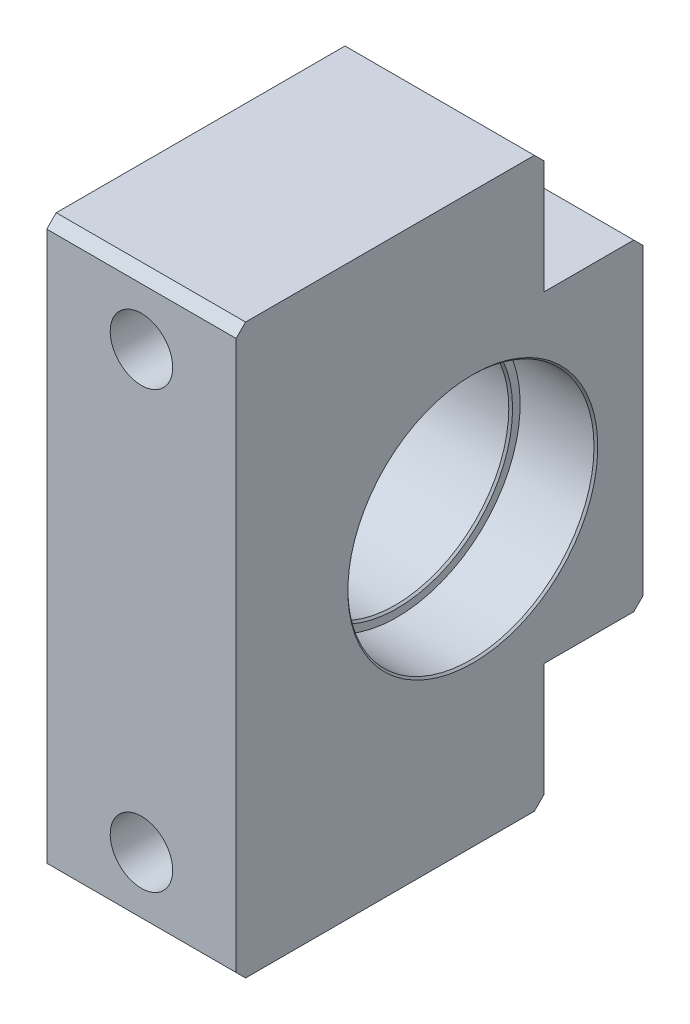
ISO-10303-21;
HEADER;
FILE_DESCRIPTION(('STEP AP214'),'2;1');
FILE_NAME('part.step','',(''),(''),'','','');
FILE_SCHEMA(('AUTOMOTIVE_DESIGN { 1 0 10303 214 1 1 1 1 }'));
ENDSEC;
DATA;
#1=APPLICATION_CONTEXT('core data for automotive mechanical design processes');
#2=APPLICATION_PROTOCOL_DEFINITION('international standard','automotive_design',2000,#1);
#3=PRODUCT_CONTEXT('',#1,'mechanical');
#4=PRODUCT('Part','Part','',(#3));
#5=PRODUCT_RELATED_PRODUCT_CATEGORY('part','',(#4));
#6=PRODUCT_DEFINITION_FORMATION('','',#4);
#7=PRODUCT_DEFINITION_CONTEXT('part definition',#1,'design');
#8=PRODUCT_DEFINITION('design','',#6,#7);
#9=PRODUCT_DEFINITION_SHAPE('','',#8);
#10=(LENGTH_UNIT() NAMED_UNIT(*) SI_UNIT(.MILLI.,.METRE.));
#11=(NAMED_UNIT(*) PLANE_ANGLE_UNIT() SI_UNIT($,.RADIAN.));
#12=(NAMED_UNIT(*) SI_UNIT($,.STERADIAN.) SOLID_ANGLE_UNIT());
#13=UNCERTAINTY_MEASURE_WITH_UNIT(LENGTH_MEASURE(1.E-05),#10,'distance_accuracy_value','');
#14=(GEOMETRIC_REPRESENTATION_CONTEXT(3) GLOBAL_UNCERTAINTY_ASSIGNED_CONTEXT((#13)) GLOBAL_UNIT_ASSIGNED_CONTEXT((#10,
#11,#12)) REPRESENTATION_CONTEXT('',''));
#15=CARTESIAN_POINT('',(0.,0.,0.));
#16=DIRECTION('',(0.,0.,1.));
#17=DIRECTION('',(1.,0.,0.));
#18=AXIS2_PLACEMENT_3D('',#15,#16,#17);
#19=CARTESIAN_POINT('',(17.7505100088882,0.,-27.6794951112317));
#20=DIRECTION('',(1.,0.,0.));
#21=DIRECTION('',(0.,0.,-1.));
#22=AXIS2_PLACEMENT_3D('',#19,#20,#21);
#23=PLANE('',#22);
#24=CARTESIAN_POINT('',(17.7505100088882,0.,-27.6794951112317));
#25=DIRECTION('',(-1.,0.,0.));
#26=DIRECTION('',(0.,0.,1.));
#27=AXIS2_PLACEMENT_3D('',#24,#25,#26);
#28=CIRCLE('',#27,13.);
#29=CARTESIAN_POINT('',(17.7505100088882,0.,-14.6794951112317));
#30=VERTEX_POINT('',#29);
#31=EDGE_CURVE('E20',#30,#30,#28,.F.);
#32=ORIENTED_EDGE('',*,*,#31,.T.);
#33=EDGE_LOOP('',(#32));
#34=FACE_BOUND('',#33,.T.);
#35=CARTESIAN_POINT('',(17.7505100088882,0.,-27.6794951112317));
#36=DIRECTION('',(1.,0.,0.));
#37=DIRECTION('',(0.,0.,-1.));
#38=AXIS2_PLACEMENT_3D('',#35,#36,#37);
#39=CIRCLE('',#38,12.2);
#40=CARTESIAN_POINT('',(17.7505100088882,0.,-39.8794951112317));
#41=VERTEX_POINT('',#40);
#42=EDGE_CURVE('E181',#41,#41,#39,.F.);
#43=ORIENTED_EDGE('',*,*,#42,.T.);
#44=EDGE_LOOP('',(#43));
#45=FACE_BOUND('',#44,.T.);
#46=ADVANCED_FACE('F17',(#34,#45),#23,.T.);
#47=CARTESIAN_POINT('',(25.7505100088882,0.,-27.6794951112317));
#48=DIRECTION('',(-1.,0.,0.));
#49=DIRECTION('',(0.,0.,1.));
#50=AXIS2_PLACEMENT_3D('',#47,#48,#49);
#51=CYLINDRICAL_SURFACE('',#50,13.);
#52=ORIENTED_EDGE('',*,*,#31,.F.);
#53=EDGE_LOOP('',(#52));
#54=FACE_BOUND('',#53,.T.);
#55=CARTESIAN_POINT('',(25.5505100088882,0.,-27.6794951112317));
#56=DIRECTION('',(1.,0.,0.));
#57=DIRECTION('',(0.,0.,-1.));
#58=AXIS2_PLACEMENT_3D('',#55,#56,#57);
#59=CIRCLE('',#58,13.);
#60=CARTESIAN_POINT('',(25.5505100088882,0.,-40.6794951112317));
#61=VERTEX_POINT('',#60);
#62=EDGE_CURVE('E178',#61,#61,#59,.T.);
#63=ORIENTED_EDGE('',*,*,#62,.T.);
#64=EDGE_LOOP('',(#63));
#65=FACE_BOUND('',#64,.T.);
#66=ADVANCED_FACE('F215',(#54,#65),#51,.F.);
#67=CARTESIAN_POINT('',(17.7505100088882,0.,-27.6794951112317));
#68=DIRECTION('',(1.,0.,0.));
#69=DIRECTION('',(0.,0.,-1.));
#70=AXIS2_PLACEMENT_3D('',#67,#68,#69);
#71=CONICAL_SURFACE('',#70,12.2,0.785398163397457);
#72=CARTESIAN_POINT('',(17.5505100088882,0.,-27.6794951112317));
#73=DIRECTION('',(-1.,0.,0.));
#74=DIRECTION('',(0.,0.,1.));
#75=AXIS2_PLACEMENT_3D('',#72,#73,#74);
#76=CIRCLE('',#75,12.);
#77=CARTESIAN_POINT('',(17.5505100088882,0.,-15.6794951112317));
#78=VERTEX_POINT('',#77);
#79=EDGE_CURVE('E174',#78,#78,#76,.T.);
#80=ORIENTED_EDGE('',*,*,#79,.T.);
#81=EDGE_LOOP('',(#80));
#82=FACE_BOUND('',#81,.T.);
#83=ORIENTED_EDGE('',*,*,#42,.F.);
#84=EDGE_LOOP('',(#83));
#85=FACE_BOUND('',#84,.T.);
#86=ADVANCED_FACE('F218',(#82,#85),#71,.F.);
#87=CARTESIAN_POINT('',(19.0505100088882,23.,-33.1794951112318));
#88=DIRECTION('',(0.,0.,1.));
#89=DIRECTION('',(0.,-1.,0.));
#90=AXIS2_PLACEMENT_3D('',#87,#88,#89);
#91=PLANE('',#90);
#92=CARTESIAN_POINT('',(15.7505100088882,23.,-33.1794951112318));
#93=DIRECTION('',(0.,0.,-1.));
#94=DIRECTION('',(0.,1.,0.));
#95=AXIS2_PLACEMENT_3D('',#92,#93,#94);
#96=CIRCLE('',#95,5.75);
#97=CARTESIAN_POINT('',(15.7505100088882,28.75,-33.1794951112318));
#98=VERTEX_POINT('',#97);
#99=EDGE_CURVE('E169',#98,#98,#96,.T.);
#100=ORIENTED_EDGE('',*,*,#99,.T.);
#101=EDGE_LOOP('',(#100));
#102=FACE_BOUND('',#101,.T.);
#103=CARTESIAN_POINT('',(15.7505100088882,23.,-33.1794951112318));
#104=DIRECTION('',(0.,0.,-1.));
#105=DIRECTION('',(0.,1.,0.));
#106=AXIS2_PLACEMENT_3D('',#103,#104,#105);
#107=CIRCLE('',#106,3.29999999999999);
#108=CARTESIAN_POINT('',(15.7505100088882,26.3,-33.1794951112318));
#109=VERTEX_POINT('',#108);
#110=EDGE_CURVE('E177',#109,#109,#107,.F.);
#111=ORIENTED_EDGE('',*,*,#110,.T.);
#112=EDGE_LOOP('',(#111));
#113=FACE_BOUND('',#112,.T.);
#114=ADVANCED_FACE('F235',(#102,#113),#91,.F.);
#115=CARTESIAN_POINT('',(19.0505100088882,-23.,-33.1794951112318));
#116=DIRECTION('',(0.,0.,1.));
#117=DIRECTION('',(0.,-1.,0.));
#118=AXIS2_PLACEMENT_3D('',#115,#116,#117);
#119=PLANE('',#118);
#120=CARTESIAN_POINT('',(15.7505100088882,-23.,-33.1794951112318));
#121=DIRECTION('',(0.,0.,-1.));
#122=DIRECTION('',(0.,1.,0.));
#123=AXIS2_PLACEMENT_3D('',#120,#121,#122);
#124=CIRCLE('',#123,5.75);
#125=CARTESIAN_POINT('',(15.7505100088882,-17.25,-33.1794951112318));
#126=VERTEX_POINT('',#125);
#127=EDGE_CURVE('E164',#126,#126,#124,.T.);
#128=ORIENTED_EDGE('',*,*,#127,.T.);
#129=EDGE_LOOP('',(#128));
#130=FACE_BOUND('',#129,.T.);
#131=CARTESIAN_POINT('',(15.7505100088882,-23.,-33.1794951112318));
#132=DIRECTION('',(0.,0.,-1.));
#133=DIRECTION('',(0.,1.,0.));
#134=AXIS2_PLACEMENT_3D('',#131,#132,#133);
#135=CIRCLE('',#134,3.29999999999999);
#136=CARTESIAN_POINT('',(15.7505100088882,-19.7,-33.1794951112318));
#137=VERTEX_POINT('',#136);
#138=EDGE_CURVE('E171',#137,#137,#135,.F.);
#139=ORIENTED_EDGE('',*,*,#138,.T.);
#140=EDGE_LOOP('',(#139));
#141=FACE_BOUND('',#140,.T.);
#142=ADVANCED_FACE('F224',(#130,#141),#119,.F.);
#143=CARTESIAN_POINT('',(25.7505100088882,0.,-27.6794951112317));
#144=DIRECTION('',(1.,0.,0.));
#145=DIRECTION('',(0.,1.,0.));
#146=AXIS2_PLACEMENT_3D('',#143,#144,#145);
#147=CONICAL_SURFACE('',#146,13.2,0.785398163397448);
#148=CARTESIAN_POINT('',(25.7505100088882,0.,-27.6794951112317));
#149=DIRECTION('',(1.,0.,0.));
#150=DIRECTION('',(0.,1.,0.));
#151=AXIS2_PLACEMENT_3D('',#148,#149,#150);
#152=CIRCLE('',#151,13.2);
#153=CARTESIAN_POINT('',(25.7505100088882,13.2,-27.6794951112317));
#154=VERTEX_POINT('',#153);
#155=EDGE_CURVE('E161',#154,#154,#152,.T.);
#156=ORIENTED_EDGE('',*,*,#155,.T.);
#157=EDGE_LOOP('',(#156));
#158=FACE_BOUND('',#157,.T.);
#159=ORIENTED_EDGE('',*,*,#62,.F.);
#160=EDGE_LOOP('',(#159));
#161=FACE_BOUND('',#160,.T.);
#162=ADVANCED_FACE('F221',(#158,#161),#147,.F.);
#163=CARTESIAN_POINT('',(17.7505100088882,0.,-27.6794951112317));
#164=DIRECTION('',(-1.,0.,0.));
#165=DIRECTION('',(0.,0.,1.));
#166=AXIS2_PLACEMENT_3D('',#163,#164,#165);
#167=CYLINDRICAL_SURFACE('',#166,12.);
#168=ORIENTED_EDGE('',*,*,#79,.F.);
#169=EDGE_LOOP('',(#168));
#170=FACE_BOUND('',#169,.T.);
#171=CARTESIAN_POINT('',(5.95051000888817,0.,-27.6794951112317));
#172=DIRECTION('',(-1.,0.,0.));
#173=DIRECTION('',(0.,0.,1.));
#174=AXIS2_PLACEMENT_3D('',#171,#172,#173);
#175=CIRCLE('',#174,12.);
#176=CARTESIAN_POINT('',(5.95051000888818,0.,-15.6794951112317));
#177=VERTEX_POINT('',#176);
#178=EDGE_CURVE('E150',#177,#177,#175,.T.);
#179=ORIENTED_EDGE('',*,*,#178,.T.);
#180=EDGE_LOOP('',(#179));
#181=FACE_BOUND('',#180,.T.);
#182=ADVANCED_FACE('F223',(#170,#181),#167,.F.);
#183=CARTESIAN_POINT('',(15.7505100088882,23.,-35.1794951112318));
#184=DIRECTION('',(0.,0.,-1.));
#185=DIRECTION('',(0.,1.,0.));
#186=AXIS2_PLACEMENT_3D('',#183,#184,#185);
#187=CYLINDRICAL_SURFACE('',#186,3.29999999999999);
#188=CARTESIAN_POINT('',(15.7505100088882,23.,-2.67949511123176));
#189=DIRECTION('',(0.,0.,-1.));
#190=DIRECTION('',(0.,1.,0.));
#191=AXIS2_PLACEMENT_3D('',#188,#189,#190);
#192=CIRCLE('',#191,3.29999999999999);
#193=CARTESIAN_POINT('',(15.7505100088882,26.3,-2.67949511123177));
#194=VERTEX_POINT('',#193);
#195=EDGE_CURVE('E144',#194,#194,#192,.T.);
#196=ORIENTED_EDGE('',*,*,#195,.F.);
#197=EDGE_LOOP('',(#196));
#198=FACE_BOUND('',#197,.T.);
#199=ORIENTED_EDGE('',*,*,#110,.F.);
#200=EDGE_LOOP('',(#199));
#201=FACE_BOUND('',#200,.T.);
#202=ADVANCED_FACE('F232',(#198,#201),#187,.F.);
#203=CARTESIAN_POINT('',(15.7505100088882,-23.,-35.1794951112318));
#204=DIRECTION('',(0.,0.,-1.));
#205=DIRECTION('',(0.,1.,0.));
#206=AXIS2_PLACEMENT_3D('',#203,#204,#205);
#207=CYLINDRICAL_SURFACE('',#206,3.29999999999999);
#208=CARTESIAN_POINT('',(15.7505100088882,-23.,-2.67949511123173));
#209=DIRECTION('',(0.,0.,-1.));
#210=DIRECTION('',(0.,1.,0.));
#211=AXIS2_PLACEMENT_3D('',#208,#209,#210);
#212=CIRCLE('',#211,3.29999999999999);
#213=CARTESIAN_POINT('',(15.7505100088882,-19.7,-2.67949511123173));
#214=VERTEX_POINT('',#213);
#215=EDGE_CURVE('E141',#214,#214,#212,.T.);
#216=ORIENTED_EDGE('',*,*,#215,.F.);
#217=EDGE_LOOP('',(#216));
#218=FACE_BOUND('',#217,.T.);
#219=ORIENTED_EDGE('',*,*,#138,.F.);
#220=EDGE_LOOP('',(#219));
#221=FACE_BOUND('',#220,.T.);
#222=ADVANCED_FACE('F311',(#218,#221),#207,.F.);
#223=CARTESIAN_POINT('',(25.7505100088882,29.,-2.67949511123177));
#224=DIRECTION('',(0.,-0.707106781186551,-0.707106781186544));
#225=DIRECTION('',(0.,0.707106781186544,-0.707106781186551));
#226=AXIS2_PLACEMENT_3D('',#223,#224,#225);
#227=PLANE('',#226);
#228=DIRECTION('',(1.,0.,0.));
#229=VECTOR('',#228,1.);
#230=CARTESIAN_POINT('',(25.7505100088882,30.,-3.67949511123178));
#231=LINE('',#230,#229);
#232=CARTESIAN_POINT('',(5.75051000888817,30.,-3.67949511123178));
#233=VERTEX_POINT('',#232);
#234=CARTESIAN_POINT('',(25.7505100088882,30.,-3.67949511123178));
#235=VERTEX_POINT('',#234);
#236=EDGE_CURVE('E581',#233,#235,#231,.T.);
#237=ORIENTED_EDGE('',*,*,#236,.F.);
#238=DIRECTION('',(0.,0.707106781186544,-0.707106781186551));
#239=VECTOR('',#238,1.);
#240=CARTESIAN_POINT('',(5.75051000888817,29.,-2.67949511123177));
#241=LINE('',#240,#239);
#242=CARTESIAN_POINT('',(5.75051000888817,29.,-2.67949511123175));
#243=VERTEX_POINT('',#242);
#244=EDGE_CURVE('E132',#243,#233,#241,.T.);
#245=ORIENTED_EDGE('',*,*,#244,.F.);
#246=DIRECTION('',(1.,0.,0.));
#247=VECTOR('',#246,1.);
#248=CARTESIAN_POINT('',(25.7505100088882,29.,-2.67949511123177));
#249=LINE('',#248,#247);
#250=CARTESIAN_POINT('',(25.7505100088882,29.,-2.67949511123175));
#251=VERTEX_POINT('',#250);
#252=EDGE_CURVE('E130',#251,#243,#249,.F.);
#253=ORIENTED_EDGE('',*,*,#252,.F.);
#254=DIRECTION('',(0.,0.707106781186538,-0.707106781186557));
#255=VECTOR('',#254,1.);
#256=CARTESIAN_POINT('',(25.7505100088882,29.,-2.67949511123175));
#257=LINE('',#256,#255);
#258=EDGE_CURVE('E118',#251,#235,#257,.T.);
#259=ORIENTED_EDGE('',*,*,#258,.T.);
#260=EDGE_LOOP('',(#237,#245,#253,#259));
#261=FACE_BOUND('',#260,.T.);
#262=ADVANCED_FACE('F131',(#261),#227,.F.);
#263=CARTESIAN_POINT('',(15.7505100088882,23.,-35.1794951112318));
#264=DIRECTION('',(0.,0.,-1.));
#265=DIRECTION('',(0.,1.,0.));
#266=AXIS2_PLACEMENT_3D('',#263,#264,#265);
#267=CYLINDRICAL_SURFACE('',#266,5.75);
#268=CARTESIAN_POINT('',(15.7505100088882,23.,-35.1794951112318));
#269=DIRECTION('',(0.,0.,-1.));
#270=DIRECTION('',(0.,1.,0.));
#271=AXIS2_PLACEMENT_3D('',#268,#269,#270);
#272=CIRCLE('',#271,5.75);
#273=CARTESIAN_POINT('',(15.7505100088882,28.75,-35.1794951112318));
#274=VERTEX_POINT('',#273);
#275=EDGE_CURVE('E192',#274,#274,#272,.F.);
#276=ORIENTED_EDGE('',*,*,#275,.F.);
#277=EDGE_LOOP('',(#276));
#278=FACE_BOUND('',#277,.T.);
#279=ORIENTED_EDGE('',*,*,#99,.F.);
#280=EDGE_LOOP('',(#279));
#281=FACE_BOUND('',#280,.T.);
#282=ADVANCED_FACE('F304',(#278,#281),#267,.F.);
#283=CARTESIAN_POINT('',(25.7505100088882,30.,-34.1794951112318));
#284=DIRECTION('',(0.,-0.707106781186545,0.70710678118655));
#285=DIRECTION('',(0.,-0.70710678118655,-0.707106781186545));
#286=AXIS2_PLACEMENT_3D('',#283,#284,#285);
#287=PLANE('',#286);
#288=DIRECTION('',(1.,0.,0.));
#289=VECTOR('',#288,1.);
#290=CARTESIAN_POINT('',(25.7505100088882,29.,-35.1794951112318));
#291=LINE('',#290,#289);
#292=CARTESIAN_POINT('',(5.75051000888817,29.,-35.1794951112318));
#293=VERTEX_POINT('',#292);
#294=CARTESIAN_POINT('',(25.7505100088882,29.,-35.1794951112318));
#295=VERTEX_POINT('',#294);
#296=EDGE_CURVE('E194',#293,#295,#291,.T.);
#297=ORIENTED_EDGE('',*,*,#296,.F.);
#298=DIRECTION('',(0.,-0.70710678118655,-0.707106781186545));
#299=VECTOR('',#298,1.);
#300=CARTESIAN_POINT('',(5.75051000888817,30.,-34.1794951112318));
#301=LINE('',#300,#299);
#302=CARTESIAN_POINT('',(5.75051000888817,30.,-34.1794951112318));
#303=VERTEX_POINT('',#302);
#304=EDGE_CURVE('E167',#303,#293,#301,.T.);
#305=ORIENTED_EDGE('',*,*,#304,.F.);
#306=DIRECTION('',(1.,0.,0.));
#307=VECTOR('',#306,1.);
#308=CARTESIAN_POINT('',(25.7505100088882,30.,-34.1794951112318));
#309=LINE('',#308,#307);
#310=CARTESIAN_POINT('',(25.7505100088882,30.,-34.1794951112318));
#311=VERTEX_POINT('',#310);
#312=EDGE_CURVE('E195',#311,#303,#309,.F.);
#313=ORIENTED_EDGE('',*,*,#312,.F.);
#314=DIRECTION('',(0.,-0.707106781186549,-0.707106781186546));
#315=VECTOR('',#314,1.);
#316=CARTESIAN_POINT('',(25.7505100088882,30.,-34.1794951112318));
#317=LINE('',#316,#315);
#318=EDGE_CURVE('E159',#311,#295,#317,.T.);
#319=ORIENTED_EDGE('',*,*,#318,.T.);
#320=EDGE_LOOP('',(#297,#305,#313,#319));
#321=FACE_BOUND('',#320,.T.);
#322=ADVANCED_FACE('F300',(#321),#287,.F.);
#323=CARTESIAN_POINT('',(25.7505100088882,17.,-44.6794951112318));
#324=DIRECTION('',(0.,-0.707106781186545,0.70710678118655));
#325=DIRECTION('',(0.,-0.70710678118655,-0.707106781186545));
#326=AXIS2_PLACEMENT_3D('',#323,#324,#325);
#327=PLANE('',#326);
#328=DIRECTION('',(1.,0.,0.));
#329=VECTOR('',#328,1.);
#330=CARTESIAN_POINT('',(25.7505100088882,16.,-45.6794951112318));
#331=LINE('',#330,#329);
#332=CARTESIAN_POINT('',(5.75051000888817,16.,-45.6794951112318));
#333=VERTEX_POINT('',#332);
#334=CARTESIAN_POINT('',(25.7505100088882,16.,-45.6794951112318));
#335=VERTEX_POINT('',#334);
#336=EDGE_CURVE('E562',#333,#335,#331,.T.);
#337=ORIENTED_EDGE('',*,*,#336,.F.);
#338=DIRECTION('',(0.,-0.70710678118655,-0.707106781186545));
#339=VECTOR('',#338,1.);
#340=CARTESIAN_POINT('',(5.75051000888817,17.,-44.6794951112318));
#341=LINE('',#340,#339);
#342=CARTESIAN_POINT('',(5.75051000888817,17.,-44.6794951112318));
#343=VERTEX_POINT('',#342);
#344=EDGE_CURVE('E165',#343,#333,#341,.T.);
#345=ORIENTED_EDGE('',*,*,#344,.F.);
#346=DIRECTION('',(1.,0.,0.));
#347=VECTOR('',#346,1.);
#348=CARTESIAN_POINT('',(25.7505100088882,17.,-44.6794951112318));
#349=LINE('',#348,#347);
#350=CARTESIAN_POINT('',(25.7505100088882,17.,-44.6794951112318));
#351=VERTEX_POINT('',#350);
#352=EDGE_CURVE('E572',#351,#343,#349,.F.);
#353=ORIENTED_EDGE('',*,*,#352,.F.);
#354=DIRECTION('',(0.,-0.70710678118655,-0.707106781186545));
#355=VECTOR('',#354,1.);
#356=CARTESIAN_POINT('',(25.7505100088882,17.,-44.6794951112318));
#357=LINE('',#356,#355);
#358=EDGE_CURVE('E157',#351,#335,#357,.T.);
#359=ORIENTED_EDGE('',*,*,#358,.T.);
#360=EDGE_LOOP('',(#337,#345,#353,#359));
#361=FACE_BOUND('',#360,.T.);
#362=ADVANCED_FACE('F296',(#361),#327,.F.);
#363=CARTESIAN_POINT('',(25.7505100088882,-16.,-45.6794951112318));
#364=DIRECTION('',(0.,0.707106781186548,0.707106781186548));
#365=DIRECTION('',(0.,-0.707106781186548,0.707106781186548));
#366=AXIS2_PLACEMENT_3D('',#363,#364,#365);
#367=PLANE('',#366);
#368=DIRECTION('',(1.,0.,0.));
#369=VECTOR('',#368,1.);
#370=CARTESIAN_POINT('',(25.7505100088882,-17.,-44.6794951112318));
#371=LINE('',#370,#369);
#372=CARTESIAN_POINT('',(5.75051000888817,-17.,-44.6794951112318));
#373=VERTEX_POINT('',#372);
#374=CARTESIAN_POINT('',(25.7505100088882,-17.,-44.6794951112318));
#375=VERTEX_POINT('',#374);
#376=EDGE_CURVE('E559',#373,#375,#371,.T.);
#377=ORIENTED_EDGE('',*,*,#376,.F.);
#378=DIRECTION('',(0.,-0.707106781186548,0.707106781186548));
#379=VECTOR('',#378,1.);
#380=CARTESIAN_POINT('',(5.75051000888817,-16.,-45.6794951112318));
#381=LINE('',#380,#379);
#382=CARTESIAN_POINT('',(5.75051000888817,-16.,-45.6794951112318));
#383=VERTEX_POINT('',#382);
#384=EDGE_CURVE('E162',#383,#373,#381,.T.);
#385=ORIENTED_EDGE('',*,*,#384,.F.);
#386=DIRECTION('',(1.,0.,0.));
#387=VECTOR('',#386,1.);
#388=CARTESIAN_POINT('',(25.7505100088882,-16.,-45.6794951112318));
#389=LINE('',#388,#387);
#390=CARTESIAN_POINT('',(25.7505100088882,-16.,-45.6794951112318));
#391=VERTEX_POINT('',#390);
#392=EDGE_CURVE('E565',#391,#383,#389,.F.);
#393=ORIENTED_EDGE('',*,*,#392,.F.);
#394=DIRECTION('',(0.,-0.707106781186547,0.707106781186547));
#395=VECTOR('',#394,1.);
#396=CARTESIAN_POINT('',(25.7505100088882,-16.,-45.6794951112318));
#397=LINE('',#396,#395);
#398=EDGE_CURVE('E127',#391,#375,#397,.T.);
#399=ORIENTED_EDGE('',*,*,#398,.T.);
#400=EDGE_LOOP('',(#377,#385,#393,#399));
#401=FACE_BOUND('',#400,.T.);
#402=ADVANCED_FACE('F292',(#401),#367,.F.);
#403=CARTESIAN_POINT('',(15.7505100088882,-23.,-35.1794951112318));
#404=DIRECTION('',(0.,0.,-1.));
#405=DIRECTION('',(0.,1.,0.));
#406=AXIS2_PLACEMENT_3D('',#403,#404,#405);
#407=CYLINDRICAL_SURFACE('',#406,5.75);
#408=CARTESIAN_POINT('',(15.7505100088882,-23.,-35.1794951112318));
#409=DIRECTION('',(0.,0.,-1.));
#410=DIRECTION('',(0.,1.,0.));
#411=AXIS2_PLACEMENT_3D('',#408,#409,#410);
#412=CIRCLE('',#411,5.75);
#413=CARTESIAN_POINT('',(15.7505100088882,-17.25,-35.1794951112318));
#414=VERTEX_POINT('',#413);
#415=EDGE_CURVE('E187',#414,#414,#412,.F.);
#416=ORIENTED_EDGE('',*,*,#415,.F.);
#417=EDGE_LOOP('',(#416));
#418=FACE_BOUND('',#417,.T.);
#419=ORIENTED_EDGE('',*,*,#127,.F.);
#420=EDGE_LOOP('',(#419));
#421=FACE_BOUND('',#420,.T.);
#422=ADVANCED_FACE('F289',(#418,#421),#407,.F.);
#423=CARTESIAN_POINT('',(25.7505100088882,0.,0.));
#424=DIRECTION('',(-1.,0.,0.));
#425=DIRECTION('',(0.,0.,1.));
#426=AXIS2_PLACEMENT_3D('',#423,#424,#425);
#427=PLANE('',#426);
#428=ORIENTED_EDGE('',*,*,#258,.F.);
#429=DIRECTION('',(0.,-1.,0.));
#430=VECTOR('',#429,1.);
#431=CARTESIAN_POINT('',(25.7505100088882,30.,-2.67949511123177));
#432=LINE('',#431,#430);
#433=CARTESIAN_POINT('',(25.7505100088882,-29.,-2.67949511123173));
#434=VERTEX_POINT('',#433);
#435=EDGE_CURVE('E115',#434,#251,#432,.F.);
#436=ORIENTED_EDGE('',*,*,#435,.F.);
#437=DIRECTION('',(0.,0.707106781186549,0.707106781186546));
#438=VECTOR('',#437,1.);
#439=CARTESIAN_POINT('',(25.7505100088882,-30.,-3.67949511123175));
#440=LINE('',#439,#438);
#441=CARTESIAN_POINT('',(25.7505100088882,-30.,-3.67949511123176));
#442=VERTEX_POINT('',#441);
#443=EDGE_CURVE('E153',#434,#442,#440,.F.);
#444=ORIENTED_EDGE('',*,*,#443,.T.);
#445=DIRECTION('',(0.,0.,-1.));
#446=VECTOR('',#445,1.);
#447=CARTESIAN_POINT('',(25.7505100088882,-30.,-35.1794951112318));
#448=LINE('',#447,#446);
#449=CARTESIAN_POINT('',(25.7505100088882,-30.,-34.1794951112318));
#450=VERTEX_POINT('',#449);
#451=EDGE_CURVE('E546',#450,#442,#448,.F.);
#452=ORIENTED_EDGE('',*,*,#451,.F.);
#453=DIRECTION('',(0.,-0.707106781186545,0.70710678118655));
#454=VECTOR('',#453,1.);
#455=CARTESIAN_POINT('',(25.7505100088882,-29.,-35.1794951112318));
#456=LINE('',#455,#454);
#457=CARTESIAN_POINT('',(25.7505100088882,-29.,-35.1794951112318));
#458=VERTEX_POINT('',#457);
#459=EDGE_CURVE('E148',#450,#458,#456,.F.);
#460=ORIENTED_EDGE('',*,*,#459,.T.);
#461=DIRECTION('',(0.,1.,0.));
#462=VECTOR('',#461,1.);
#463=CARTESIAN_POINT('',(25.7505100088882,-17.,-35.1794951112318));
#464=LINE('',#463,#462);
#465=CARTESIAN_POINT('',(25.7505100088882,-17.,-35.1794951112318));
#466=VERTEX_POINT('',#465);
#467=EDGE_CURVE('E190',#466,#458,#464,.F.);
#468=ORIENTED_EDGE('',*,*,#467,.F.);
#469=DIRECTION('',(0.,0.,-1.));
#470=VECTOR('',#469,1.);
#471=CARTESIAN_POINT('',(25.7505100088882,-17.,-45.6794951112318));
#472=LINE('',#471,#470);
#473=EDGE_CURVE('E191',#375,#466,#472,.F.);
#474=ORIENTED_EDGE('',*,*,#473,.F.);
#475=ORIENTED_EDGE('',*,*,#398,.F.);
#476=DIRECTION('',(0.,1.,0.));
#477=VECTOR('',#476,1.);
#478=CARTESIAN_POINT('',(25.7505100088882,17.,-45.6794951112318));
#479=LINE('',#478,#477);
#480=EDGE_CURVE('E568',#335,#391,#479,.F.);
#481=ORIENTED_EDGE('',*,*,#480,.F.);
#482=ORIENTED_EDGE('',*,*,#358,.F.);
#483=DIRECTION('',(0.,0.,1.));
#484=VECTOR('',#483,1.);
#485=CARTESIAN_POINT('',(25.7505100088882,17.,-45.6794951112318));
#486=LINE('',#485,#484);
#487=CARTESIAN_POINT('',(25.7505100088882,17.,-35.1794951112318));
#488=VERTEX_POINT('',#487);
#489=EDGE_CURVE('E575',#488,#351,#486,.F.);
#490=ORIENTED_EDGE('',*,*,#489,.F.);
#491=DIRECTION('',(0.,1.,0.));
#492=VECTOR('',#491,1.);
#493=CARTESIAN_POINT('',(25.7505100088882,17.,-35.1794951112318));
#494=LINE('',#493,#492);
#495=EDGE_CURVE('E524',#295,#488,#494,.F.);
#496=ORIENTED_EDGE('',*,*,#495,.F.);
#497=ORIENTED_EDGE('',*,*,#318,.F.);
#498=DIRECTION('',(0.,0.,1.));
#499=VECTOR('',#498,1.);
#500=CARTESIAN_POINT('',(25.7505100088882,30.,-35.1794951112318));
#501=LINE('',#500,#499);
#502=EDGE_CURVE('E123',#235,#311,#501,.F.);
#503=ORIENTED_EDGE('',*,*,#502,.F.);
#504=EDGE_LOOP('',(#428,#436,#444,#452,#460,#468,#474,#475,#481,#482,#490,#496,#497,#503));
#505=FACE_BOUND('',#504,.T.);
#506=ORIENTED_EDGE('',*,*,#155,.F.);
#507=EDGE_LOOP('',(#506));
#508=FACE_BOUND('',#507,.T.);
#509=ADVANCED_FACE('F120',(#505,#508),#427,.F.);
#510=CARTESIAN_POINT('',(25.7505100088882,-30.,-3.67949511123175));
#511=DIRECTION('',(0.,0.707106781186546,-0.707106781186549));
#512=DIRECTION('',(0.,0.707106781186549,0.707106781186546));
#513=AXIS2_PLACEMENT_3D('',#510,#511,#512);
#514=PLANE('',#513);
#515=DIRECTION('',(1.,0.,0.));
#516=VECTOR('',#515,1.);
#517=CARTESIAN_POINT('',(25.7505100088882,-29.,-2.67949511123173));
#518=LINE('',#517,#516);
#519=CARTESIAN_POINT('',(5.75051000888817,-29.,-2.67949511123173));
#520=VERTEX_POINT('',#519);
#521=EDGE_CURVE('E136',#520,#434,#518,.T.);
#522=ORIENTED_EDGE('',*,*,#521,.F.);
#523=DIRECTION('',(0.,0.707106781186549,0.707106781186546));
#524=VECTOR('',#523,1.);
#525=CARTESIAN_POINT('',(5.75051000888817,-30.,-3.67949511123175));
#526=LINE('',#525,#524);
#527=CARTESIAN_POINT('',(5.75051000888817,-30.,-3.67949511123176));
#528=VERTEX_POINT('',#527);
#529=EDGE_CURVE('E35',#528,#520,#526,.T.);
#530=ORIENTED_EDGE('',*,*,#529,.F.);
#531=DIRECTION('',(1.,0.,0.));
#532=VECTOR('',#531,1.);
#533=CARTESIAN_POINT('',(25.7505100088882,-30.,-3.67949511123175));
#534=LINE('',#533,#532);
#535=EDGE_CURVE('E544',#442,#528,#534,.F.);
#536=ORIENTED_EDGE('',*,*,#535,.F.);
#537=ORIENTED_EDGE('',*,*,#443,.F.);
#538=EDGE_LOOP('',(#522,#530,#536,#537));
#539=FACE_BOUND('',#538,.T.);
#540=ADVANCED_FACE('F283',(#539),#514,.F.);
#541=CARTESIAN_POINT('',(25.7505100088882,-29.,-35.1794951112318));
#542=DIRECTION('',(0.,0.70710678118655,0.707106781186545));
#543=DIRECTION('',(0.,-0.707106781186545,0.70710678118655));
#544=AXIS2_PLACEMENT_3D('',#541,#542,#543);
#545=PLANE('',#544);
#546=DIRECTION('',(1.,0.,0.));
#547=VECTOR('',#546,1.);
#548=CARTESIAN_POINT('',(25.7505100088882,-30.,-34.1794951112318));
#549=LINE('',#548,#547);
#550=CARTESIAN_POINT('',(5.75051000888817,-30.,-34.1794951112318));
#551=VERTEX_POINT('',#550);
#552=EDGE_CURVE('E186',#551,#450,#549,.T.);
#553=ORIENTED_EDGE('',*,*,#552,.F.);
#554=DIRECTION('',(0.,-0.707106781186545,0.70710678118655));
#555=VECTOR('',#554,1.);
#556=CARTESIAN_POINT('',(5.75051000888817,-29.,-35.1794951112318));
#557=LINE('',#556,#555);
#558=CARTESIAN_POINT('',(5.75051000888817,-29.,-35.1794951112318));
#559=VERTEX_POINT('',#558);
#560=EDGE_CURVE('E151',#559,#551,#557,.T.);
#561=ORIENTED_EDGE('',*,*,#560,.F.);
#562=DIRECTION('',(1.,0.,0.));
#563=VECTOR('',#562,1.);
#564=CARTESIAN_POINT('',(25.7505100088882,-29.,-35.1794951112318));
#565=LINE('',#564,#563);
#566=EDGE_CURVE('E552',#458,#559,#565,.F.);
#567=ORIENTED_EDGE('',*,*,#566,.F.);
#568=ORIENTED_EDGE('',*,*,#459,.F.);
#569=EDGE_LOOP('',(#553,#561,#567,#568));
#570=FACE_BOUND('',#569,.T.);
#571=ADVANCED_FACE('F279',(#570),#545,.F.);
#572=CARTESIAN_POINT('',(5.75051000888817,0.,-27.6794951112317));
#573=DIRECTION('',(-1.,0.,0.));
#574=DIRECTION('',(0.,0.,1.));
#575=AXIS2_PLACEMENT_3D('',#572,#573,#574);
#576=CONICAL_SURFACE('',#575,12.2,0.785398163397448);
#577=ORIENTED_EDGE('',*,*,#178,.F.);
#578=EDGE_LOOP('',(#577));
#579=FACE_BOUND('',#578,.T.);
#580=CARTESIAN_POINT('',(5.75051000888817,0.,-27.6794951112317));
#581=DIRECTION('',(-1.,0.,0.));
#582=DIRECTION('',(0.,0.,1.));
#583=AXIS2_PLACEMENT_3D('',#580,#581,#582);
#584=CIRCLE('',#583,12.2);
#585=CARTESIAN_POINT('',(5.75051000888817,0.,-15.4794951112317));
#586=VERTEX_POINT('',#585);
#587=EDGE_CURVE('E182',#586,#586,#584,.F.);
#588=ORIENTED_EDGE('',*,*,#587,.F.);
#589=EDGE_LOOP('',(#588));
#590=FACE_BOUND('',#589,.T.);
#591=ADVANCED_FACE('F276',(#579,#590),#576,.F.);
#592=CARTESIAN_POINT('',(25.7505100088882,30.,-2.67949511123177));
#593=DIRECTION('',(0.,0.,1.));
#594=DIRECTION('',(0.,-1.,0.));
#595=AXIS2_PLACEMENT_3D('',#592,#593,#594);
#596=PLANE('',#595);
#597=DIRECTION('',(0.,1.,0.));
#598=VECTOR('',#597,1.);
#599=CARTESIAN_POINT('',(5.75051000888817,0.,-2.67949511123173));
#600=LINE('',#599,#598);
#601=EDGE_CURVE('E185',#520,#243,#600,.T.);
#602=ORIENTED_EDGE('',*,*,#601,.F.);
#603=ORIENTED_EDGE('',*,*,#521,.T.);
#604=ORIENTED_EDGE('',*,*,#435,.T.);
#605=ORIENTED_EDGE('',*,*,#252,.T.);
#606=EDGE_LOOP('',(#602,#603,#604,#605));
#607=FACE_BOUND('',#606,.T.);
#608=ORIENTED_EDGE('',*,*,#215,.T.);
#609=EDGE_LOOP('',(#608));
#610=FACE_BOUND('',#609,.T.);
#611=ORIENTED_EDGE('',*,*,#195,.T.);
#612=EDGE_LOOP('',(#611));
#613=FACE_BOUND('',#612,.T.);
#614=ADVANCED_FACE('F139',(#607,#610,#613),#596,.T.);
#615=CARTESIAN_POINT('',(25.7505100088882,30.,-35.1794951112318));
#616=DIRECTION('',(0.,1.,0.));
#617=DIRECTION('',(0.,0.,1.));
#618=AXIS2_PLACEMENT_3D('',#615,#616,#617);
#619=PLANE('',#618);
#620=ORIENTED_EDGE('',*,*,#502,.T.);
#621=ORIENTED_EDGE('',*,*,#312,.T.);
#622=DIRECTION('',(0.,0.,1.));
#623=VECTOR('',#622,1.);
#624=CARTESIAN_POINT('',(5.75051000888817,30.,0.));
#625=LINE('',#624,#623);
#626=EDGE_CURVE('E533',#233,#303,#625,.F.);
#627=ORIENTED_EDGE('',*,*,#626,.F.);
#628=ORIENTED_EDGE('',*,*,#236,.T.);
#629=EDGE_LOOP('',(#620,#621,#627,#628));
#630=FACE_BOUND('',#629,.T.);
#631=ADVANCED_FACE('F269',(#630),#619,.T.);
#632=CARTESIAN_POINT('',(25.7505100088882,17.,-35.1794951112318));
#633=DIRECTION('',(0.,0.,-1.));
#634=DIRECTION('',(0.,1.,0.));
#635=AXIS2_PLACEMENT_3D('',#632,#633,#634);
#636=PLANE('',#635);
#637=ORIENTED_EDGE('',*,*,#495,.T.);
#638=DIRECTION('',(1.,0.,0.));
#639=VECTOR('',#638,1.);
#640=CARTESIAN_POINT('',(25.7505100088882,17.,-35.1794951112318));
#641=LINE('',#640,#639);
#642=CARTESIAN_POINT('',(5.75051000888817,17.,-35.1794951112318));
#643=VERTEX_POINT('',#642);
#644=EDGE_CURVE('E529',#643,#488,#641,.T.);
#645=ORIENTED_EDGE('',*,*,#644,.F.);
#646=DIRECTION('',(0.,1.,0.));
#647=VECTOR('',#646,1.);
#648=CARTESIAN_POINT('',(5.75051000888817,0.,-35.1794951112318));
#649=LINE('',#648,#647);
#650=EDGE_CURVE('E527',#293,#643,#649,.F.);
#651=ORIENTED_EDGE('',*,*,#650,.F.);
#652=ORIENTED_EDGE('',*,*,#296,.T.);
#653=EDGE_LOOP('',(#637,#645,#651,#652));
#654=FACE_BOUND('',#653,.T.);
#655=ORIENTED_EDGE('',*,*,#275,.T.);
#656=EDGE_LOOP('',(#655));
#657=FACE_BOUND('',#656,.T.);
#658=ADVANCED_FACE('F265',(#654,#657),#636,.T.);
#659=CARTESIAN_POINT('',(25.7505100088882,17.,-45.6794951112318));
#660=DIRECTION('',(0.,1.,0.));
#661=DIRECTION('',(0.,0.,1.));
#662=AXIS2_PLACEMENT_3D('',#659,#660,#661);
#663=PLANE('',#662);
#664=DIRECTION('',(0.,0.,1.));
#665=VECTOR('',#664,1.);
#666=CARTESIAN_POINT('',(5.75051000888817,17.,0.));
#667=LINE('',#666,#665);
#668=EDGE_CURVE('E532',#643,#343,#667,.F.);
#669=ORIENTED_EDGE('',*,*,#668,.F.);
#670=ORIENTED_EDGE('',*,*,#644,.T.);
#671=ORIENTED_EDGE('',*,*,#489,.T.);
#672=ORIENTED_EDGE('',*,*,#352,.T.);
#673=EDGE_LOOP('',(#669,#670,#671,#672));
#674=FACE_BOUND('',#673,.T.);
#675=ADVANCED_FACE('F261',(#674),#663,.T.);
#676=CARTESIAN_POINT('',(25.7505100088882,17.,-45.6794951112318));
#677=DIRECTION('',(0.,0.,-1.));
#678=DIRECTION('',(0.,1.,0.));
#679=AXIS2_PLACEMENT_3D('',#676,#677,#678);
#680=PLANE('',#679);
#681=DIRECTION('',(0.,1.,0.));
#682=VECTOR('',#681,1.);
#683=CARTESIAN_POINT('',(5.75051000888817,0.,-45.6794951112318));
#684=LINE('',#683,#682);
#685=EDGE_CURVE('E535',#333,#383,#684,.F.);
#686=ORIENTED_EDGE('',*,*,#685,.F.);
#687=ORIENTED_EDGE('',*,*,#336,.T.);
#688=ORIENTED_EDGE('',*,*,#480,.T.);
#689=ORIENTED_EDGE('',*,*,#392,.T.);
#690=EDGE_LOOP('',(#686,#687,#688,#689));
#691=FACE_BOUND('',#690,.T.);
#692=ADVANCED_FACE('F257',(#691),#680,.T.);
#693=CARTESIAN_POINT('',(25.7505100088882,-17.,-45.6794951112318));
#694=DIRECTION('',(0.,-1.,0.));
#695=DIRECTION('',(0.,0.,-1.));
#696=AXIS2_PLACEMENT_3D('',#693,#694,#695);
#697=PLANE('',#696);
#698=ORIENTED_EDGE('',*,*,#473,.T.);
#699=DIRECTION('',(1.,0.,0.));
#700=VECTOR('',#699,1.);
#701=CARTESIAN_POINT('',(25.7505100088882,-17.,-35.1794951112318));
#702=LINE('',#701,#700);
#703=CARTESIAN_POINT('',(5.75051000888817,-17.,-35.1794951112318));
#704=VERTEX_POINT('',#703);
#705=EDGE_CURVE('E549',#704,#466,#702,.T.);
#706=ORIENTED_EDGE('',*,*,#705,.F.);
#707=DIRECTION('',(0.,0.,1.));
#708=VECTOR('',#707,1.);
#709=CARTESIAN_POINT('',(5.75051000888817,-17.,0.));
#710=LINE('',#709,#708);
#711=EDGE_CURVE('E594',#373,#704,#710,.T.);
#712=ORIENTED_EDGE('',*,*,#711,.F.);
#713=ORIENTED_EDGE('',*,*,#376,.T.);
#714=EDGE_LOOP('',(#698,#706,#712,#713));
#715=FACE_BOUND('',#714,.T.);
#716=ADVANCED_FACE('F253',(#715),#697,.T.);
#717=CARTESIAN_POINT('',(25.7505100088882,-17.,-35.1794951112318));
#718=DIRECTION('',(0.,0.,-1.));
#719=DIRECTION('',(0.,1.,0.));
#720=AXIS2_PLACEMENT_3D('',#717,#718,#719);
#721=PLANE('',#720);
#722=DIRECTION('',(0.,1.,0.));
#723=VECTOR('',#722,1.);
#724=CARTESIAN_POINT('',(5.75051000888817,0.,-35.1794951112318));
#725=LINE('',#724,#723);
#726=EDGE_CURVE('E26',#704,#559,#725,.F.);
#727=ORIENTED_EDGE('',*,*,#726,.F.);
#728=ORIENTED_EDGE('',*,*,#705,.T.);
#729=ORIENTED_EDGE('',*,*,#467,.T.);
#730=ORIENTED_EDGE('',*,*,#566,.T.);
#731=EDGE_LOOP('',(#727,#728,#729,#730));
#732=FACE_BOUND('',#731,.T.);
#733=ORIENTED_EDGE('',*,*,#415,.T.);
#734=EDGE_LOOP('',(#733));
#735=FACE_BOUND('',#734,.T.);
#736=ADVANCED_FACE('F246',(#732,#735),#721,.T.);
#737=CARTESIAN_POINT('',(25.7505100088882,-30.,-35.1794951112318));
#738=DIRECTION('',(0.,-1.,0.));
#739=DIRECTION('',(0.,0.,-1.));
#740=AXIS2_PLACEMENT_3D('',#737,#738,#739);
#741=PLANE('',#740);
#742=DIRECTION('',(0.,0.,1.));
#743=VECTOR('',#742,1.);
#744=CARTESIAN_POINT('',(5.75051000888817,-30.,0.));
#745=LINE('',#744,#743);
#746=EDGE_CURVE('E10',#551,#528,#745,.T.);
#747=ORIENTED_EDGE('',*,*,#746,.F.);
#748=ORIENTED_EDGE('',*,*,#552,.T.);
#749=ORIENTED_EDGE('',*,*,#451,.T.);
#750=ORIENTED_EDGE('',*,*,#535,.T.);
#751=EDGE_LOOP('',(#747,#748,#749,#750));
#752=FACE_BOUND('',#751,.T.);
#753=ADVANCED_FACE('F240',(#752),#741,.T.);
#754=CARTESIAN_POINT('',(5.75051000888817,0.,0.));
#755=DIRECTION('',(-1.,0.,0.));
#756=DIRECTION('',(0.,0.,1.));
#757=AXIS2_PLACEMENT_3D('',#754,#755,#756);
#758=PLANE('',#757);
#759=ORIENTED_EDGE('',*,*,#746,.T.);
#760=ORIENTED_EDGE('',*,*,#529,.T.);
#761=ORIENTED_EDGE('',*,*,#601,.T.);
#762=ORIENTED_EDGE('',*,*,#244,.T.);
#763=ORIENTED_EDGE('',*,*,#626,.T.);
#764=ORIENTED_EDGE('',*,*,#304,.T.);
#765=ORIENTED_EDGE('',*,*,#650,.T.);
#766=ORIENTED_EDGE('',*,*,#668,.T.);
#767=ORIENTED_EDGE('',*,*,#344,.T.);
#768=ORIENTED_EDGE('',*,*,#685,.T.);
#769=ORIENTED_EDGE('',*,*,#384,.T.);
#770=ORIENTED_EDGE('',*,*,#711,.T.);
#771=ORIENTED_EDGE('',*,*,#726,.T.);
#772=ORIENTED_EDGE('',*,*,#560,.T.);
#773=EDGE_LOOP('',(#759,#760,#761,#762,#763,#764,#765,#766,#767,#768,#769,#770,#771,#772));
#774=FACE_BOUND('',#773,.T.);
#775=ORIENTED_EDGE('',*,*,#587,.T.);
#776=EDGE_LOOP('',(#775));
#777=FACE_BOUND('',#776,.T.);
#778=ADVANCED_FACE('F238',(#774,#777),#758,.T.);
#779=CLOSED_SHELL('',(#46,#66,#86,#114,#142,#162,#182,#202,#222,#262,#282,#322,#362,#402,#422,
#509,#540,#571,#591,#614,#631,#658,#675,#692,#716,#736,#753,#778));
#780=MANIFOLD_SOLID_BREP('B1',#779);
#781=ADVANCED_BREP_SHAPE_REPRESENTATION('',(#18,#780),#14);
#782=SHAPE_DEFINITION_REPRESENTATION(#9,#781);
ENDSEC;
END-ISO-10303-21;
